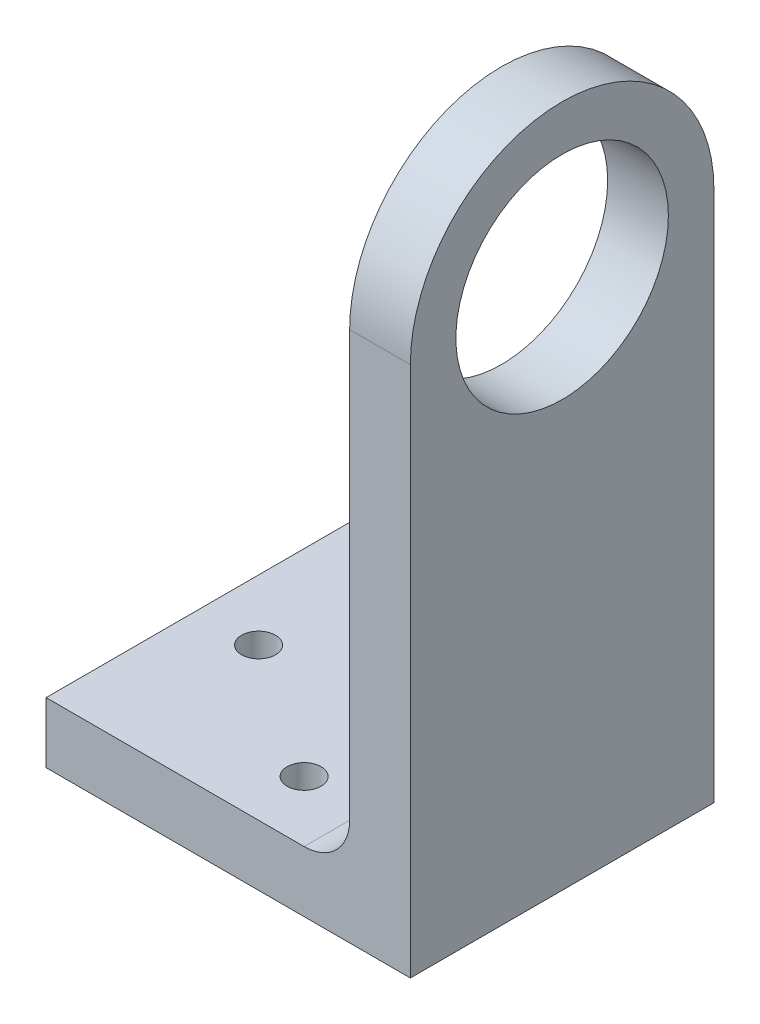
ISO-10303-21;
HEADER;
FILE_DESCRIPTION(('STEP AP214'),'2;1');
FILE_NAME('part.step','',(''),(''),'','','');
FILE_SCHEMA(('AUTOMOTIVE_DESIGN { 1 0 10303 214 1 1 1 1 }'));
ENDSEC;
DATA;
#1=APPLICATION_CONTEXT('core data for automotive mechanical design processes');
#2=APPLICATION_PROTOCOL_DEFINITION('international standard','automotive_design',2000,#1);
#3=PRODUCT_CONTEXT('',#1,'mechanical');
#4=PRODUCT('Part','Part','',(#3));
#5=PRODUCT_RELATED_PRODUCT_CATEGORY('part','',(#4));
#6=PRODUCT_DEFINITION_FORMATION('','',#4);
#7=PRODUCT_DEFINITION_CONTEXT('part definition',#1,'design');
#8=PRODUCT_DEFINITION('design','',#6,#7);
#9=PRODUCT_DEFINITION_SHAPE('','',#8);
#10=(LENGTH_UNIT() NAMED_UNIT(*) SI_UNIT(.MILLI.,.METRE.));
#11=(NAMED_UNIT(*) PLANE_ANGLE_UNIT() SI_UNIT($,.RADIAN.));
#12=(NAMED_UNIT(*) SI_UNIT($,.STERADIAN.) SOLID_ANGLE_UNIT());
#13=UNCERTAINTY_MEASURE_WITH_UNIT(LENGTH_MEASURE(1.E-05),#10,'distance_accuracy_value','');
#14=(GEOMETRIC_REPRESENTATION_CONTEXT(3) GLOBAL_UNCERTAINTY_ASSIGNED_CONTEXT((#13)) GLOBAL_UNIT_ASSIGNED_CONTEXT((#10,
#11,#12)) REPRESENTATION_CONTEXT('',''));
#15=CARTESIAN_POINT('',(0.,0.,0.));
#16=DIRECTION('',(0.,0.,1.));
#17=DIRECTION('',(1.,0.,0.));
#18=AXIS2_PLACEMENT_3D('',#15,#16,#17);
#19=CARTESIAN_POINT('',(6.35,49.2125,-15.875));
#20=DIRECTION('',(-1.,0.,0.));
#21=DIRECTION('',(0.,0.,1.));
#22=AXIS2_PLACEMENT_3D('',#19,#20,#21);
#23=PLANE('',#22);
#24=DIRECTION('',(0.,-1.,0.));
#25=VECTOR('',#24,1.);
#26=CARTESIAN_POINT('',(6.35,0.,0.));
#27=LINE('',#26,#25);
#28=CARTESIAN_POINT('',(6.35,49.2125,0.));
#29=VERTEX_POINT('',#28);
#30=CARTESIAN_POINT('',(6.35,-6.35,0.));
#31=VERTEX_POINT('',#30);
#32=EDGE_CURVE('E143',#29,#31,#27,.T.);
#33=ORIENTED_EDGE('',*,*,#32,.T.);
#34=DIRECTION('',(0.,0.,-1.));
#35=VECTOR('',#34,1.);
#36=CARTESIAN_POINT('',(6.35,-6.35,0.));
#37=LINE('',#36,#35);
#38=CARTESIAN_POINT('',(6.35,-6.34999999999999,-31.75));
#39=VERTEX_POINT('',#38);
#40=EDGE_CURVE('E103',#31,#39,#37,.T.);
#41=ORIENTED_EDGE('',*,*,#40,.T.);
#42=DIRECTION('',(0.,1.,0.));
#43=VECTOR('',#42,1.);
#44=CARTESIAN_POINT('',(6.35,0.,-31.75));
#45=LINE('',#44,#43);
#46=CARTESIAN_POINT('',(6.35,49.2125,-31.75));
#47=VERTEX_POINT('',#46);
#48=EDGE_CURVE('E145',#39,#47,#45,.T.);
#49=ORIENTED_EDGE('',*,*,#48,.T.);
#50=CARTESIAN_POINT('',(6.35,49.2125,-15.875));
#51=DIRECTION('',(1.,0.,0.));
#52=DIRECTION('',(0.,0.,1.));
#53=AXIS2_PLACEMENT_3D('',#50,#51,#52);
#54=CIRCLE('',#53,15.875);
#55=EDGE_CURVE('E148',#47,#29,#54,.T.);
#56=ORIENTED_EDGE('',*,*,#55,.T.);
#57=EDGE_LOOP('',(#33,#41,#49,#56));
#58=FACE_BOUND('',#57,.T.);
#59=CARTESIAN_POINT('',(6.35,49.2125,-15.875));
#60=DIRECTION('',(1.,0.,0.));
#61=DIRECTION('',(0.,0.,-1.));
#62=AXIS2_PLACEMENT_3D('',#59,#60,#61);
#63=CIRCLE('',#62,11.1125);
#64=CARTESIAN_POINT('',(6.35,49.2125,-26.9875));
#65=VERTEX_POINT('',#64);
#66=EDGE_CURVE('E137',#65,#65,#63,.T.);
#67=ORIENTED_EDGE('',*,*,#66,.F.);
#68=EDGE_LOOP('',(#67));
#69=FACE_BOUND('',#68,.T.);
#70=ADVANCED_FACE('F38',(#58,#69),#23,.F.);
#71=CARTESIAN_POINT('',(0.,49.2125,-15.875));
#72=DIRECTION('',(-1.,0.,0.));
#73=DIRECTION('',(0.,0.,1.));
#74=AXIS2_PLACEMENT_3D('',#71,#72,#73);
#75=PLANE('',#74);
#76=DIRECTION('',(0.,1.,0.));
#77=VECTOR('',#76,1.);
#78=CARTESIAN_POINT('',(0.,0.,-31.75));
#79=LINE('',#78,#77);
#80=CARTESIAN_POINT('',(0.,4.76250000000001,-31.75));
#81=VERTEX_POINT('',#80);
#82=CARTESIAN_POINT('',(0.,49.2125,-31.75));
#83=VERTEX_POINT('',#82);
#84=EDGE_CURVE('E152',#81,#83,#79,.T.);
#85=ORIENTED_EDGE('',*,*,#84,.F.);
#86=DIRECTION('',(0.,0.,-1.));
#87=VECTOR('',#86,1.);
#88=CARTESIAN_POINT('',(0.,4.7625,0.));
#89=LINE('',#88,#87);
#90=CARTESIAN_POINT('',(0.,4.7625,0.));
#91=VERTEX_POINT('',#90);
#92=EDGE_CURVE('E59',#81,#91,#89,.F.);
#93=ORIENTED_EDGE('',*,*,#92,.T.);
#94=DIRECTION('',(0.,-1.,0.));
#95=VECTOR('',#94,1.);
#96=CARTESIAN_POINT('',(0.,0.,0.));
#97=LINE('',#96,#95);
#98=CARTESIAN_POINT('',(0.,49.2125,0.));
#99=VERTEX_POINT('',#98);
#100=EDGE_CURVE('E140',#99,#91,#97,.T.);
#101=ORIENTED_EDGE('',*,*,#100,.F.);
#102=CARTESIAN_POINT('',(0.,49.2125,-15.875));
#103=DIRECTION('',(1.,0.,0.));
#104=DIRECTION('',(0.,0.,1.));
#105=AXIS2_PLACEMENT_3D('',#102,#103,#104);
#106=CIRCLE('',#105,15.875);
#107=EDGE_CURVE('E146',#83,#99,#106,.T.);
#108=ORIENTED_EDGE('',*,*,#107,.F.);
#109=EDGE_LOOP('',(#85,#93,#101,#108));
#110=FACE_BOUND('',#109,.T.);
#111=CARTESIAN_POINT('',(0.,49.2125,-15.875));
#112=DIRECTION('',(1.,0.,0.));
#113=DIRECTION('',(0.,0.,-1.));
#114=AXIS2_PLACEMENT_3D('',#111,#112,#113);
#115=CIRCLE('',#114,11.1125);
#116=CARTESIAN_POINT('',(0.,49.2125,-26.9875));
#117=VERTEX_POINT('',#116);
#118=EDGE_CURVE('E133',#117,#117,#115,.T.);
#119=ORIENTED_EDGE('',*,*,#118,.T.);
#120=EDGE_LOOP('',(#119));
#121=FACE_BOUND('',#120,.T.);
#122=ADVANCED_FACE('F176',(#110,#121),#75,.T.);
#123=CARTESIAN_POINT('',(6.35,0.,0.));
#124=DIRECTION('',(0.,0.,-1.));
#125=DIRECTION('',(-1.,0.,0.));
#126=AXIS2_PLACEMENT_3D('',#123,#124,#125);
#127=PLANE('',#126);
#128=ORIENTED_EDGE('',*,*,#100,.T.);
#129=CARTESIAN_POINT('',(-4.7625,4.7625,0.));
#130=DIRECTION('',(0.,0.,-1.));
#131=DIRECTION('',(-1.,0.,0.));
#132=AXIS2_PLACEMENT_3D('',#129,#130,#131);
#133=CIRCLE('',#132,4.7625);
#134=CARTESIAN_POINT('',(-4.76250000000001,0.,0.));
#135=VERTEX_POINT('',#134);
#136=EDGE_CURVE('E11',#91,#135,#133,.T.);
#137=ORIENTED_EDGE('',*,*,#136,.T.);
#138=DIRECTION('',(1.,0.,0.));
#139=VECTOR('',#138,1.);
#140=CARTESIAN_POINT('',(-31.75,0.,0.));
#141=LINE('',#140,#139);
#142=CARTESIAN_POINT('',(-31.75,0.,0.));
#143=VERTEX_POINT('',#142);
#144=EDGE_CURVE('E122',#143,#135,#141,.T.);
#145=ORIENTED_EDGE('',*,*,#144,.F.);
#146=DIRECTION('',(0.,-1.,0.));
#147=VECTOR('',#146,1.);
#148=CARTESIAN_POINT('',(-31.75,0.,0.));
#149=LINE('',#148,#147);
#150=CARTESIAN_POINT('',(-31.75,-6.35,0.));
#151=VERTEX_POINT('',#150);
#152=EDGE_CURVE('E115',#143,#151,#149,.T.);
#153=ORIENTED_EDGE('',*,*,#152,.T.);
#154=DIRECTION('',(1.,0.,0.));
#155=VECTOR('',#154,1.);
#156=CARTESIAN_POINT('',(-31.75,-6.35,0.));
#157=LINE('',#156,#155);
#158=EDGE_CURVE('E97',#151,#31,#157,.T.);
#159=ORIENTED_EDGE('',*,*,#158,.T.);
#160=ORIENTED_EDGE('',*,*,#32,.F.);
#161=DIRECTION('',(-1.,0.,0.));
#162=VECTOR('',#161,1.);
#163=CARTESIAN_POINT('',(6.35,49.2125,0.));
#164=LINE('',#163,#162);
#165=EDGE_CURVE('E150',#29,#99,#164,.T.);
#166=ORIENTED_EDGE('',*,*,#165,.T.);
#167=EDGE_LOOP('',(#128,#137,#145,#153,#159,#160,#166));
#168=FACE_BOUND('',#167,.T.);
#169=ADVANCED_FACE('F120',(#168),#127,.F.);
#170=CARTESIAN_POINT('',(6.35,0.,-31.75));
#171=DIRECTION('',(0.,0.,1.));
#172=DIRECTION('',(1.,0.,0.));
#173=AXIS2_PLACEMENT_3D('',#170,#171,#172);
#174=PLANE('',#173);
#175=DIRECTION('',(1.,0.,0.));
#176=VECTOR('',#175,1.);
#177=CARTESIAN_POINT('',(-31.75,0.,-31.75));
#178=LINE('',#177,#176);
#179=CARTESIAN_POINT('',(-31.75,0.,-31.75));
#180=VERTEX_POINT('',#179);
#181=CARTESIAN_POINT('',(-4.76250000000001,0.,-31.75));
#182=VERTEX_POINT('',#181);
#183=EDGE_CURVE('E134',#180,#182,#178,.T.);
#184=ORIENTED_EDGE('',*,*,#183,.T.);
#185=CARTESIAN_POINT('',(-4.7625,4.76250000000001,-31.75));
#186=DIRECTION('',(0.,0.,1.));
#187=DIRECTION('',(1.,0.,0.));
#188=AXIS2_PLACEMENT_3D('',#185,#186,#187);
#189=CIRCLE('',#188,4.7625);
#190=EDGE_CURVE('E46',#182,#81,#189,.T.);
#191=ORIENTED_EDGE('',*,*,#190,.T.);
#192=ORIENTED_EDGE('',*,*,#84,.T.);
#193=DIRECTION('',(-1.,0.,0.));
#194=VECTOR('',#193,1.);
#195=CARTESIAN_POINT('',(6.35,49.2125,-31.75));
#196=LINE('',#195,#194);
#197=EDGE_CURVE('E157',#47,#83,#196,.T.);
#198=ORIENTED_EDGE('',*,*,#197,.F.);
#199=ORIENTED_EDGE('',*,*,#48,.F.);
#200=DIRECTION('',(1.,0.,0.));
#201=VECTOR('',#200,1.);
#202=CARTESIAN_POINT('',(-31.75,-6.34999999999999,-31.75));
#203=LINE('',#202,#201);
#204=CARTESIAN_POINT('',(-31.75,-6.34999999999999,-31.75));
#205=VERTEX_POINT('',#204);
#206=EDGE_CURVE('E107',#205,#39,#203,.T.);
#207=ORIENTED_EDGE('',*,*,#206,.F.);
#208=DIRECTION('',(0.,1.,0.));
#209=VECTOR('',#208,1.);
#210=CARTESIAN_POINT('',(-31.75,0.,-31.75));
#211=LINE('',#210,#209);
#212=EDGE_CURVE('E118',#205,#180,#211,.T.);
#213=ORIENTED_EDGE('',*,*,#212,.T.);
#214=EDGE_LOOP('',(#184,#191,#192,#198,#199,#207,#213));
#215=FACE_BOUND('',#214,.T.);
#216=ADVANCED_FACE('F168',(#215),#174,.F.);
#217=CARTESIAN_POINT('',(6.35,49.2125,-15.875));
#218=DIRECTION('',(-1.,0.,0.));
#219=DIRECTION('',(0.,0.,1.));
#220=AXIS2_PLACEMENT_3D('',#217,#218,#219);
#221=CYLINDRICAL_SURFACE('',#220,15.875);
#222=ORIENTED_EDGE('',*,*,#107,.T.);
#223=ORIENTED_EDGE('',*,*,#165,.F.);
#224=ORIENTED_EDGE('',*,*,#55,.F.);
#225=ORIENTED_EDGE('',*,*,#197,.T.);
#226=EDGE_LOOP('',(#222,#223,#224,#225));
#227=FACE_BOUND('',#226,.T.);
#228=ADVANCED_FACE('F178',(#227),#221,.T.);
#229=CARTESIAN_POINT('',(6.35,49.2125,-15.875));
#230=DIRECTION('',(-1.,0.,0.));
#231=DIRECTION('',(0.,0.,1.));
#232=AXIS2_PLACEMENT_3D('',#229,#230,#231);
#233=CYLINDRICAL_SURFACE('',#232,11.1125);
#234=ORIENTED_EDGE('',*,*,#66,.T.);
#235=EDGE_LOOP('',(#234));
#236=FACE_BOUND('',#235,.T.);
#237=ORIENTED_EDGE('',*,*,#118,.F.);
#238=EDGE_LOOP('',(#237));
#239=FACE_BOUND('',#238,.T.);
#240=ADVANCED_FACE('F180',(#236,#239),#233,.F.);
#241=CARTESIAN_POINT('',(-31.75,0.,0.));
#242=DIRECTION('',(0.,1.,0.));
#243=DIRECTION('',(0.,0.,1.));
#244=AXIS2_PLACEMENT_3D('',#241,#242,#243);
#245=PLANE('',#244);
#246=CARTESIAN_POINT('',(-11.1125,0.,-6.35));
#247=DIRECTION('',(0.,1.,0.));
#248=DIRECTION('',(0.,0.,1.));
#249=AXIS2_PLACEMENT_3D('',#246,#247,#248);
#250=CIRCLE('',#249,1.777000002);
#251=CARTESIAN_POINT('',(-11.1125,0.,-4.572999998));
#252=VERTEX_POINT('',#251);
#253=EDGE_CURVE('E222',#252,#252,#250,.T.);
#254=ORIENTED_EDGE('',*,*,#253,.F.);
#255=EDGE_LOOP('',(#254));
#256=FACE_BOUND('',#255,.T.);
#257=CARTESIAN_POINT('',(-11.1125,0.,-25.4));
#258=DIRECTION('',(0.,1.,0.));
#259=DIRECTION('',(0.,0.,-1.));
#260=AXIS2_PLACEMENT_3D('',#257,#258,#259);
#261=CIRCLE('',#260,1.777000002);
#262=CARTESIAN_POINT('',(-11.1125,0.,-27.177000002));
#263=VERTEX_POINT('',#262);
#264=EDGE_CURVE('E223',#263,#263,#261,.T.);
#265=ORIENTED_EDGE('',*,*,#264,.F.);
#266=EDGE_LOOP('',(#265));
#267=FACE_BOUND('',#266,.T.);
#268=CARTESIAN_POINT('',(-25.4,0.,-15.875));
#269=DIRECTION('',(0.,1.,0.));
#270=DIRECTION('',(0.,0.,1.));
#271=AXIS2_PLACEMENT_3D('',#268,#269,#270);
#272=CIRCLE('',#271,1.777000002);
#273=CARTESIAN_POINT('',(-25.4,0.,-14.097999998));
#274=VERTEX_POINT('',#273);
#275=EDGE_CURVE('E231',#274,#274,#272,.T.);
#276=ORIENTED_EDGE('',*,*,#275,.F.);
#277=EDGE_LOOP('',(#276));
#278=FACE_BOUND('',#277,.T.);
#279=ORIENTED_EDGE('',*,*,#144,.T.);
#280=DIRECTION('',(0.,0.,-1.));
#281=VECTOR('',#280,1.);
#282=CARTESIAN_POINT('',(-4.7625,0.,-31.75));
#283=LINE('',#282,#281);
#284=EDGE_CURVE('E160',#135,#182,#283,.T.);
#285=ORIENTED_EDGE('',*,*,#284,.T.);
#286=ORIENTED_EDGE('',*,*,#183,.F.);
#287=DIRECTION('',(0.,0.,1.));
#288=VECTOR('',#287,1.);
#289=CARTESIAN_POINT('',(-31.75,0.,0.));
#290=LINE('',#289,#288);
#291=EDGE_CURVE('E108',#180,#143,#290,.T.);
#292=ORIENTED_EDGE('',*,*,#291,.T.);
#293=EDGE_LOOP('',(#279,#285,#286,#292));
#294=FACE_BOUND('',#293,.T.);
#295=ADVANCED_FACE('F165',(#256,#267,#278,#294),#245,.T.);
#296=CARTESIAN_POINT('',(-31.75,-6.35,0.));
#297=DIRECTION('',(0.,-1.,0.));
#298=DIRECTION('',(0.,0.,-1.));
#299=AXIS2_PLACEMENT_3D('',#296,#297,#298);
#300=PLANE('',#299);
#301=CARTESIAN_POINT('',(-11.1125,-6.35,-6.35));
#302=DIRECTION('',(0.,1.,0.));
#303=DIRECTION('',(0.,0.,1.));
#304=AXIS2_PLACEMENT_3D('',#301,#302,#303);
#305=CIRCLE('',#304,1.777000002);
#306=CARTESIAN_POINT('',(-11.1125,-6.35,-4.572999998));
#307=VERTEX_POINT('',#306);
#308=EDGE_CURVE('E124',#307,#307,#305,.T.);
#309=ORIENTED_EDGE('',*,*,#308,.T.);
#310=EDGE_LOOP('',(#309));
#311=FACE_BOUND('',#310,.T.);
#312=CARTESIAN_POINT('',(-11.1125,-6.35,-25.4));
#313=DIRECTION('',(0.,1.,0.));
#314=DIRECTION('',(0.,0.,-1.));
#315=AXIS2_PLACEMENT_3D('',#312,#313,#314);
#316=CIRCLE('',#315,1.777000002);
#317=CARTESIAN_POINT('',(-11.1125,-6.35,-27.177000002));
#318=VERTEX_POINT('',#317);
#319=EDGE_CURVE('E227',#318,#318,#316,.T.);
#320=ORIENTED_EDGE('',*,*,#319,.T.);
#321=EDGE_LOOP('',(#320));
#322=FACE_BOUND('',#321,.T.);
#323=CARTESIAN_POINT('',(-25.4,-6.35,-15.875));
#324=DIRECTION('',(0.,1.,0.));
#325=DIRECTION('',(0.,0.,1.));
#326=AXIS2_PLACEMENT_3D('',#323,#324,#325);
#327=CIRCLE('',#326,1.777000002);
#328=CARTESIAN_POINT('',(-25.4,-6.35,-14.097999998));
#329=VERTEX_POINT('',#328);
#330=EDGE_CURVE('E127',#329,#329,#327,.T.);
#331=ORIENTED_EDGE('',*,*,#330,.T.);
#332=EDGE_LOOP('',(#331));
#333=FACE_BOUND('',#332,.T.);
#334=ORIENTED_EDGE('',*,*,#40,.F.);
#335=ORIENTED_EDGE('',*,*,#158,.F.);
#336=DIRECTION('',(0.,0.,-1.));
#337=VECTOR('',#336,1.);
#338=CARTESIAN_POINT('',(-31.75,-6.35,0.));
#339=LINE('',#338,#337);
#340=EDGE_CURVE('E101',#151,#205,#339,.T.);
#341=ORIENTED_EDGE('',*,*,#340,.T.);
#342=ORIENTED_EDGE('',*,*,#206,.T.);
#343=EDGE_LOOP('',(#334,#335,#341,#342));
#344=FACE_BOUND('',#343,.T.);
#345=ADVANCED_FACE('F99',(#311,#322,#333,#344),#300,.T.);
#346=CARTESIAN_POINT('',(-31.75,0.,0.));
#347=DIRECTION('',(1.,0.,0.));
#348=DIRECTION('',(0.,0.,-1.));
#349=AXIS2_PLACEMENT_3D('',#346,#347,#348);
#350=PLANE('',#349);
#351=ORIENTED_EDGE('',*,*,#152,.F.);
#352=ORIENTED_EDGE('',*,*,#291,.F.);
#353=ORIENTED_EDGE('',*,*,#212,.F.);
#354=ORIENTED_EDGE('',*,*,#340,.F.);
#355=EDGE_LOOP('',(#351,#352,#353,#354));
#356=FACE_BOUND('',#355,.T.);
#357=ADVANCED_FACE('F113',(#356),#350,.F.);
#358=CARTESIAN_POINT('',(-4.7625,4.7625,0.));
#359=DIRECTION('',(0.,0.,1.));
#360=DIRECTION('',(0.,-1.,0.));
#361=AXIS2_PLACEMENT_3D('',#358,#359,#360);
#362=CYLINDRICAL_SURFACE('',#361,4.7625);
#363=ORIENTED_EDGE('',*,*,#136,.F.);
#364=ORIENTED_EDGE('',*,*,#92,.F.);
#365=ORIENTED_EDGE('',*,*,#190,.F.);
#366=ORIENTED_EDGE('',*,*,#284,.F.);
#367=EDGE_LOOP('',(#363,#364,#365,#366));
#368=FACE_BOUND('',#367,.T.);
#369=ADVANCED_FACE('F40',(#368),#362,.F.);
#370=CARTESIAN_POINT('',(-25.4,-6.35,-15.875));
#371=DIRECTION('',(0.,1.,0.));
#372=DIRECTION('',(0.,0.,1.));
#373=AXIS2_PLACEMENT_3D('',#370,#371,#372);
#374=CYLINDRICAL_SURFACE('',#373,1.777000002);
#375=ORIENTED_EDGE('',*,*,#330,.F.);
#376=EDGE_LOOP('',(#375));
#377=FACE_BOUND('',#376,.T.);
#378=ORIENTED_EDGE('',*,*,#275,.T.);
#379=EDGE_LOOP('',(#378));
#380=FACE_BOUND('',#379,.T.);
#381=ADVANCED_FACE('F204',(#377,#380),#374,.F.);
#382=CARTESIAN_POINT('',(-11.1125,-6.35,-25.4));
#383=DIRECTION('',(0.,1.,0.));
#384=DIRECTION('',(0.,0.,1.));
#385=AXIS2_PLACEMENT_3D('',#382,#383,#384);
#386=CYLINDRICAL_SURFACE('',#385,1.777000002);
#387=ORIENTED_EDGE('',*,*,#319,.F.);
#388=EDGE_LOOP('',(#387));
#389=FACE_BOUND('',#388,.T.);
#390=ORIENTED_EDGE('',*,*,#264,.T.);
#391=EDGE_LOOP('',(#390));
#392=FACE_BOUND('',#391,.T.);
#393=ADVANCED_FACE('F207',(#389,#392),#386,.F.);
#394=CARTESIAN_POINT('',(-11.1125,-6.35,-6.35));
#395=DIRECTION('',(0.,1.,0.));
#396=DIRECTION('',(0.,0.,1.));
#397=AXIS2_PLACEMENT_3D('',#394,#395,#396);
#398=CYLINDRICAL_SURFACE('',#397,1.777000002);
#399=ORIENTED_EDGE('',*,*,#308,.F.);
#400=EDGE_LOOP('',(#399));
#401=FACE_BOUND('',#400,.T.);
#402=ORIENTED_EDGE('',*,*,#253,.T.);
#403=EDGE_LOOP('',(#402));
#404=FACE_BOUND('',#403,.T.);
#405=ADVANCED_FACE('F211',(#401,#404),#398,.F.);
#406=CLOSED_SHELL('',(#70,#122,#169,#216,#228,#240,#295,#345,#357,#369,#381,#393,#405));
#407=MANIFOLD_SOLID_BREP('B2',#406);
#408=ADVANCED_BREP_SHAPE_REPRESENTATION('',(#18,#407),#14);
#409=SHAPE_DEFINITION_REPRESENTATION(#9,#408);
ENDSEC;
END-ISO-10303-21;
